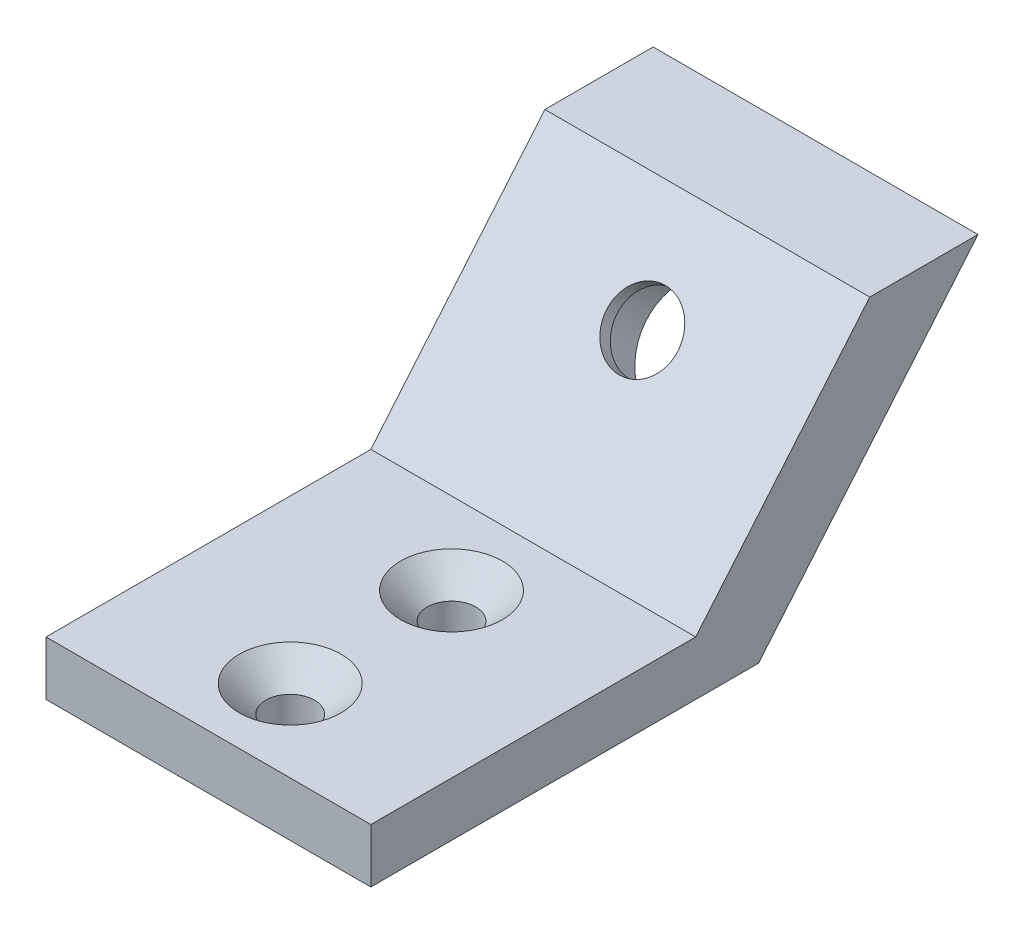
ISO-10303-21;
HEADER;
FILE_DESCRIPTION(('STEP AP214'),'2;1');
FILE_NAME('part.step','',(''),(''),'','','');
FILE_SCHEMA(('AUTOMOTIVE_DESIGN { 1 0 10303 214 1 1 1 1 }'));
ENDSEC;
DATA;
#1=APPLICATION_CONTEXT('core data for automotive mechanical design processes');
#2=APPLICATION_PROTOCOL_DEFINITION('international standard','automotive_design',2000,#1);
#3=PRODUCT_CONTEXT('',#1,'mechanical');
#4=PRODUCT('Part','Part','',(#3));
#5=PRODUCT_RELATED_PRODUCT_CATEGORY('part','',(#4));
#6=PRODUCT_DEFINITION_FORMATION('','',#4);
#7=PRODUCT_DEFINITION_CONTEXT('part definition',#1,'design');
#8=PRODUCT_DEFINITION('design','',#6,#7);
#9=PRODUCT_DEFINITION_SHAPE('','',#8);
#10=(LENGTH_UNIT() NAMED_UNIT(*) SI_UNIT(.MILLI.,.METRE.));
#11=(NAMED_UNIT(*) PLANE_ANGLE_UNIT() SI_UNIT($,.RADIAN.));
#12=(NAMED_UNIT(*) SI_UNIT($,.STERADIAN.) SOLID_ANGLE_UNIT());
#13=UNCERTAINTY_MEASURE_WITH_UNIT(LENGTH_MEASURE(1.E-05),#10,'distance_accuracy_value','');
#14=(GEOMETRIC_REPRESENTATION_CONTEXT(3) GLOBAL_UNCERTAINTY_ASSIGNED_CONTEXT((#13)) GLOBAL_UNIT_ASSIGNED_CONTEXT((#10,
#11,#12)) REPRESENTATION_CONTEXT('',''));
#15=CARTESIAN_POINT('',(0.,0.,0.));
#16=DIRECTION('',(0.,0.,1.));
#17=DIRECTION('',(1.,0.,0.));
#18=AXIS2_PLACEMENT_3D('',#15,#16,#17);
#19=CARTESIAN_POINT('',(-15.,0.,30.));
#20=DIRECTION('',(0.,-1.,0.));
#21=DIRECTION('',(1.,0.,0.));
#22=AXIS2_PLACEMENT_3D('',#19,#20,#21);
#23=PLANE('',#22);
#24=CARTESIAN_POINT('',(0.,0.,7.55));
#25=DIRECTION('',(0.,1.,0.));
#26=DIRECTION('',(0.,0.,1.));
#27=AXIS2_PLACEMENT_3D('',#24,#25,#26);
#28=CIRCLE('',#27,4.7);
#29=CARTESIAN_POINT('',(0.,0.,12.25));
#30=VERTEX_POINT('',#29);
#31=EDGE_CURVE('E166',#30,#30,#28,.T.);
#32=ORIENTED_EDGE('',*,*,#31,.F.);
#33=EDGE_LOOP('',(#32));
#34=FACE_BOUND('',#33,.T.);
#35=CARTESIAN_POINT('',(0.,0.,22.45));
#36=DIRECTION('',(0.,1.,0.));
#37=DIRECTION('',(0.,0.,1.));
#38=AXIS2_PLACEMENT_3D('',#35,#36,#37);
#39=CIRCLE('',#38,4.7);
#40=CARTESIAN_POINT('',(0.,0.,27.15));
#41=VERTEX_POINT('',#40);
#42=EDGE_CURVE('E169',#41,#41,#39,.T.);
#43=ORIENTED_EDGE('',*,*,#42,.F.);
#44=EDGE_LOOP('',(#43));
#45=FACE_BOUND('',#44,.T.);
#46=DIRECTION('',(-1.,0.,0.));
#47=VECTOR('',#46,1.);
#48=CARTESIAN_POINT('',(-15.,0.,0.));
#49=LINE('',#48,#47);
#50=CARTESIAN_POINT('',(15.,0.,0.));
#51=VERTEX_POINT('',#50);
#52=CARTESIAN_POINT('',(-15.,0.,0.));
#53=VERTEX_POINT('',#52);
#54=EDGE_CURVE('E127',#51,#53,#49,.T.);
#55=ORIENTED_EDGE('',*,*,#54,.T.);
#56=DIRECTION('',(0.,0.,-1.));
#57=VECTOR('',#56,1.);
#58=CARTESIAN_POINT('',(-15.,0.,30.));
#59=LINE('',#58,#57);
#60=CARTESIAN_POINT('',(-15.,0.,30.));
#61=VERTEX_POINT('',#60);
#62=EDGE_CURVE('E11',#61,#53,#59,.T.);
#63=ORIENTED_EDGE('',*,*,#62,.F.);
#64=DIRECTION('',(-1.,0.,0.));
#65=VECTOR('',#64,1.);
#66=CARTESIAN_POINT('',(-15.,0.,30.));
#67=LINE('',#66,#65);
#68=CARTESIAN_POINT('',(15.,0.,30.));
#69=VERTEX_POINT('',#68);
#70=EDGE_CURVE('E124',#69,#61,#67,.T.);
#71=ORIENTED_EDGE('',*,*,#70,.F.);
#72=DIRECTION('',(0.,0.,-1.));
#73=VECTOR('',#72,1.);
#74=CARTESIAN_POINT('',(15.,0.,30.));
#75=LINE('',#74,#73);
#76=EDGE_CURVE('E94',#69,#51,#75,.T.);
#77=ORIENTED_EDGE('',*,*,#76,.T.);
#78=EDGE_LOOP('',(#55,#63,#71,#77));
#79=FACE_BOUND('',#78,.T.);
#80=ADVANCED_FACE('F35',(#34,#45,#79),#23,.F.);
#81=CARTESIAN_POINT('',(-15.,-5.,30.));
#82=DIRECTION('',(1.,0.,0.));
#83=DIRECTION('',(0.,0.,-1.));
#84=AXIS2_PLACEMENT_3D('',#81,#82,#83);
#85=PLANE('',#84);
#86=ORIENTED_EDGE('',*,*,#62,.T.);
#87=DIRECTION('',(0.,0.766044443118979,-0.642787609686538));
#88=VECTOR('',#87,1.);
#89=CARTESIAN_POINT('',(-15.,0.,0.));
#90=LINE('',#89,#88);
#91=CARTESIAN_POINT('',(-15.,19.1511110779745,-16.0696902421634));
#92=VERTEX_POINT('',#91);
#93=EDGE_CURVE('E115',#53,#92,#90,.T.);
#94=ORIENTED_EDGE('',*,*,#93,.T.);
#95=DIRECTION('',(0.,0.,-1.));
#96=VECTOR('',#95,1.);
#97=CARTESIAN_POINT('',(-15.,19.1511110779745,-16.0696902421634));
#98=LINE('',#97,#96);
#99=CARTESIAN_POINT('',(-15.,19.1511110779745,-26.0696902421635));
#100=VERTEX_POINT('',#99);
#101=EDGE_CURVE('E144',#92,#100,#98,.T.);
#102=ORIENTED_EDGE('',*,*,#101,.T.);
#103=DIRECTION('',(0.,-0.766044443118979,0.642787609686538));
#104=VECTOR('',#103,1.);
#105=CARTESIAN_POINT('',(-15.,19.1511110779745,-26.0696902421634));
#106=LINE('',#105,#104);
#107=CARTESIAN_POINT('',(-15.,-5.00000000000001,-5.80450184411361));
#108=VERTEX_POINT('',#107);
#109=EDGE_CURVE('E122',#100,#108,#106,.T.);
#110=ORIENTED_EDGE('',*,*,#109,.T.);
#111=DIRECTION('',(0.,0.,-1.));
#112=VECTOR('',#111,1.);
#113=CARTESIAN_POINT('',(-15.,-5.,30.));
#114=LINE('',#113,#112);
#115=CARTESIAN_POINT('',(-15.,-5.,30.));
#116=VERTEX_POINT('',#115);
#117=EDGE_CURVE('E43',#116,#108,#114,.T.);
#118=ORIENTED_EDGE('',*,*,#117,.F.);
#119=DIRECTION('',(0.,-1.,0.));
#120=VECTOR('',#119,1.);
#121=CARTESIAN_POINT('',(-15.,-5.,30.));
#122=LINE('',#121,#120);
#123=EDGE_CURVE('E126',#61,#116,#122,.T.);
#124=ORIENTED_EDGE('',*,*,#123,.F.);
#125=EDGE_LOOP('',(#86,#94,#102,#110,#118,#124));
#126=FACE_BOUND('',#125,.T.);
#127=ADVANCED_FACE('F145',(#126),#85,.F.);
#128=CARTESIAN_POINT('',(-15.,-5.,30.));
#129=DIRECTION('',(0.,1.,0.));
#130=DIRECTION('',(-1.,0.,0.));
#131=AXIS2_PLACEMENT_3D('',#128,#129,#130);
#132=PLANE('',#131);
#133=CARTESIAN_POINT('',(0.,-5.00000000000001,7.55));
#134=DIRECTION('',(0.,1.,0.));
#135=DIRECTION('',(0.,0.,1.));
#136=AXIS2_PLACEMENT_3D('',#133,#134,#135);
#137=CIRCLE('',#136,2.25);
#138=CARTESIAN_POINT('',(0.,-5.00000000000001,9.8));
#139=VERTEX_POINT('',#138);
#140=EDGE_CURVE('E172',#139,#139,#137,.T.);
#141=ORIENTED_EDGE('',*,*,#140,.T.);
#142=EDGE_LOOP('',(#141));
#143=FACE_BOUND('',#142,.T.);
#144=CARTESIAN_POINT('',(0.,-5.00000000000001,22.45));
#145=DIRECTION('',(0.,1.,0.));
#146=DIRECTION('',(0.,0.,1.));
#147=AXIS2_PLACEMENT_3D('',#144,#145,#146);
#148=CIRCLE('',#147,2.25);
#149=CARTESIAN_POINT('',(0.,-5.00000000000001,24.7));
#150=VERTEX_POINT('',#149);
#151=EDGE_CURVE('E175',#150,#150,#148,.T.);
#152=ORIENTED_EDGE('',*,*,#151,.T.);
#153=EDGE_LOOP('',(#152));
#154=FACE_BOUND('',#153,.T.);
#155=ORIENTED_EDGE('',*,*,#117,.T.);
#156=DIRECTION('',(1.,0.,0.));
#157=VECTOR('',#156,1.);
#158=CARTESIAN_POINT('',(-50.5373735048472,-5.00000000000002,-5.80450184411361));
#159=LINE('',#158,#157);
#160=CARTESIAN_POINT('',(15.,-5.,-5.80450184411361));
#161=VERTEX_POINT('',#160);
#162=EDGE_CURVE('E97',#108,#161,#159,.T.);
#163=ORIENTED_EDGE('',*,*,#162,.T.);
#164=DIRECTION('',(0.,0.,-1.));
#165=VECTOR('',#164,1.);
#166=CARTESIAN_POINT('',(15.,-5.,30.));
#167=LINE('',#166,#165);
#168=CARTESIAN_POINT('',(15.,-5.,30.));
#169=VERTEX_POINT('',#168);
#170=EDGE_CURVE('E87',#169,#161,#167,.T.);
#171=ORIENTED_EDGE('',*,*,#170,.F.);
#172=DIRECTION('',(1.,0.,0.));
#173=VECTOR('',#172,1.);
#174=CARTESIAN_POINT('',(-15.,-5.,30.));
#175=LINE('',#174,#173);
#176=EDGE_CURVE('E55',#116,#169,#175,.T.);
#177=ORIENTED_EDGE('',*,*,#176,.F.);
#178=EDGE_LOOP('',(#155,#163,#171,#177));
#179=FACE_BOUND('',#178,.T.);
#180=ADVANCED_FACE('F98',(#143,#154,#179),#132,.F.);
#181=CARTESIAN_POINT('',(15.,-5.,30.));
#182=DIRECTION('',(-1.,0.,0.));
#183=DIRECTION('',(0.,-1.,0.));
#184=AXIS2_PLACEMENT_3D('',#181,#182,#183);
#185=PLANE('',#184);
#186=ORIENTED_EDGE('',*,*,#170,.T.);
#187=DIRECTION('',(0.,0.766044443118979,-0.642787609686538));
#188=VECTOR('',#187,1.);
#189=CARTESIAN_POINT('',(15.,19.1511110779745,-26.0696902421634));
#190=LINE('',#189,#188);
#191=CARTESIAN_POINT('',(15.,19.1511110779745,-26.0696902421634));
#192=VERTEX_POINT('',#191);
#193=EDGE_CURVE('E92',#161,#192,#190,.T.);
#194=ORIENTED_EDGE('',*,*,#193,.T.);
#195=DIRECTION('',(0.,0.,1.));
#196=VECTOR('',#195,1.);
#197=CARTESIAN_POINT('',(15.,19.1511110779745,-16.0696902421634));
#198=LINE('',#197,#196);
#199=CARTESIAN_POINT('',(15.,19.1511110779745,-16.0696902421634));
#200=VERTEX_POINT('',#199);
#201=EDGE_CURVE('E109',#192,#200,#198,.T.);
#202=ORIENTED_EDGE('',*,*,#201,.T.);
#203=DIRECTION('',(0.,-0.766044443118979,0.642787609686538));
#204=VECTOR('',#203,1.);
#205=CARTESIAN_POINT('',(15.,0.,0.));
#206=LINE('',#205,#204);
#207=EDGE_CURVE('E104',#200,#51,#206,.T.);
#208=ORIENTED_EDGE('',*,*,#207,.T.);
#209=ORIENTED_EDGE('',*,*,#76,.F.);
#210=DIRECTION('',(0.,1.,0.));
#211=VECTOR('',#210,1.);
#212=CARTESIAN_POINT('',(15.,-5.,30.));
#213=LINE('',#212,#211);
#214=EDGE_CURVE('E50',#169,#69,#213,.T.);
#215=ORIENTED_EDGE('',*,*,#214,.F.);
#216=EDGE_LOOP('',(#186,#194,#202,#208,#209,#215));
#217=FACE_BOUND('',#216,.T.);
#218=ADVANCED_FACE('F89',(#217),#185,.F.);
#219=CARTESIAN_POINT('',(0.,0.,30.));
#220=DIRECTION('',(0.,0.,1.));
#221=DIRECTION('',(1.,0.,0.));
#222=AXIS2_PLACEMENT_3D('',#219,#220,#221);
#223=PLANE('',#222);
#224=ORIENTED_EDGE('',*,*,#70,.T.);
#225=ORIENTED_EDGE('',*,*,#123,.T.);
#226=ORIENTED_EDGE('',*,*,#176,.T.);
#227=ORIENTED_EDGE('',*,*,#214,.T.);
#228=EDGE_LOOP('',(#224,#225,#226,#227));
#229=FACE_BOUND('',#228,.T.);
#230=ADVANCED_FACE('F146',(#229),#223,.T.);
#231=CARTESIAN_POINT('',(-50.5373735048472,0.,0.));
#232=DIRECTION('',(0.,0.642787609686538,0.766044443118979));
#233=DIRECTION('',(0.,-0.766044443118979,0.642787609686538));
#234=AXIS2_PLACEMENT_3D('',#231,#232,#233);
#235=PLANE('',#234);
#236=CARTESIAN_POINT('',(0.,11.9995943040483,-10.0688551548039));
#237=DIRECTION('',(0.,0.642787609686538,0.766044443118979));
#238=DIRECTION('',(0.,-0.766044443118979,0.642787609686538));
#239=AXIS2_PLACEMENT_3D('',#236,#237,#238);
#240=CIRCLE('',#239,3.3);
#241=CARTESIAN_POINT('',(0.,9.47164764175566,-7.94765604283829));
#242=VERTEX_POINT('',#241);
#243=EDGE_CURVE('E38',#242,#242,#240,.T.);
#244=ORIENTED_EDGE('',*,*,#243,.F.);
#245=EDGE_LOOP('',(#244));
#246=FACE_BOUND('',#245,.T.);
#247=ORIENTED_EDGE('',*,*,#93,.F.);
#248=ORIENTED_EDGE('',*,*,#54,.F.);
#249=ORIENTED_EDGE('',*,*,#207,.F.);
#250=DIRECTION('',(1.,0.,0.));
#251=VECTOR('',#250,1.);
#252=CARTESIAN_POINT('',(-50.5373735048472,19.1511110779745,-16.0696902421634));
#253=LINE('',#252,#251);
#254=EDGE_CURVE('E120',#92,#200,#253,.T.);
#255=ORIENTED_EDGE('',*,*,#254,.F.);
#256=EDGE_LOOP('',(#247,#248,#249,#255));
#257=FACE_BOUND('',#256,.T.);
#258=ADVANCED_FACE('F141',(#246,#257),#235,.T.);
#259=CARTESIAN_POINT('',(-50.5373735048472,19.1511110779745,-16.0696902421634));
#260=DIRECTION('',(0.,1.,0.));
#261=DIRECTION('',(0.,0.,1.));
#262=AXIS2_PLACEMENT_3D('',#259,#260,#261);
#263=PLANE('',#262);
#264=ORIENTED_EDGE('',*,*,#101,.F.);
#265=ORIENTED_EDGE('',*,*,#254,.T.);
#266=ORIENTED_EDGE('',*,*,#201,.F.);
#267=DIRECTION('',(1.,0.,0.));
#268=VECTOR('',#267,1.);
#269=CARTESIAN_POINT('',(-50.5373735048472,19.1511110779745,-26.0696902421634));
#270=LINE('',#269,#268);
#271=EDGE_CURVE('E103',#100,#192,#270,.T.);
#272=ORIENTED_EDGE('',*,*,#271,.F.);
#273=EDGE_LOOP('',(#264,#265,#266,#272));
#274=FACE_BOUND('',#273,.T.);
#275=ADVANCED_FACE('F153',(#274),#263,.T.);
#276=CARTESIAN_POINT('',(-50.5373735048472,19.1511110779745,-26.0696902421634));
#277=DIRECTION('',(0.,-0.642787609686538,-0.766044443118979));
#278=DIRECTION('',(0.,0.766044443118979,-0.642787609686538));
#279=AXIS2_PLACEMENT_3D('',#276,#277,#278);
#280=PLANE('',#279);
#281=CARTESIAN_POINT('',(0.,7.07555553898725,-15.9370960431385));
#282=DIRECTION('',(0.,-0.642787609686538,-0.766044443118979));
#283=DIRECTION('',(0.,0.766044443118979,-0.642787609686538));
#284=AXIS2_PLACEMENT_3D('',#281,#282,#283);
#285=CIRCLE('',#284,5.525);
#286=CARTESIAN_POINT('',(0.,11.3079510872196,-19.4884975866567));
#287=VERTEX_POINT('',#286);
#288=EDGE_CURVE('E184',#287,#287,#285,.T.);
#289=ORIENTED_EDGE('',*,*,#288,.F.);
#290=EDGE_LOOP('',(#289));
#291=FACE_BOUND('',#290,.T.);
#292=ORIENTED_EDGE('',*,*,#109,.F.);
#293=ORIENTED_EDGE('',*,*,#271,.T.);
#294=ORIENTED_EDGE('',*,*,#193,.F.);
#295=ORIENTED_EDGE('',*,*,#162,.F.);
#296=EDGE_LOOP('',(#292,#293,#294,#295));
#297=FACE_BOUND('',#296,.T.);
#298=ADVANCED_FACE('F106',(#291,#297),#280,.T.);
#299=CARTESIAN_POINT('',(0.,7.07555553898725,-15.9370960431385));
#300=DIRECTION('',(0.,-0.642787609686538,-0.766044443118979));
#301=DIRECTION('',(0.,0.766044443118979,-0.642787609686538));
#302=AXIS2_PLACEMENT_3D('',#299,#300,#301);
#303=CYLINDRICAL_SURFACE('',#302,3.3);
#304=ORIENTED_EDGE('',*,*,#243,.T.);
#305=EDGE_LOOP('',(#304));
#306=FACE_BOUND('',#305,.T.);
#307=CARTESIAN_POINT('',(0.,11.1893962409811,-11.0344116071771));
#308=DIRECTION('',(0.,-0.642787609686538,-0.766044443118979));
#309=DIRECTION('',(0.,0.766044443118979,-0.642787609686538));
#310=AXIS2_PLACEMENT_3D('',#307,#308,#309);
#311=CIRCLE('',#310,3.3);
#312=CARTESIAN_POINT('',(0.,13.7173429032737,-13.1556107191426));
#313=VERTEX_POINT('',#312);
#314=EDGE_CURVE('E113',#313,#313,#311,.T.);
#315=ORIENTED_EDGE('',*,*,#314,.T.);
#316=EDGE_LOOP('',(#315));
#317=FACE_BOUND('',#316,.T.);
#318=ADVANCED_FACE('F201',(#306,#317),#303,.F.);
#319=CARTESIAN_POINT('',(5.5,11.1893962409811,-11.0344116071771));
#320=DIRECTION('',(0.,0.642787609686538,0.766044443118979));
#321=DIRECTION('',(0.,-0.766044443118979,0.642787609686538));
#322=AXIS2_PLACEMENT_3D('',#319,#320,#321);
#323=PLANE('',#322);
#324=ORIENTED_EDGE('',*,*,#314,.F.);
#325=EDGE_LOOP('',(#324));
#326=FACE_BOUND('',#325,.T.);
#327=CARTESIAN_POINT('',(0.,11.1893962409811,-11.0344116071771));
#328=DIRECTION('',(0.,-0.642787609686538,-0.766044443118979));
#329=DIRECTION('',(0.,0.766044443118979,-0.642787609686538));
#330=AXIS2_PLACEMENT_3D('',#327,#328,#329);
#331=CIRCLE('',#330,5.5);
#332=CARTESIAN_POINT('',(0.,15.4026406781355,-14.569743460453));
#333=VERTEX_POINT('',#332);
#334=EDGE_CURVE('E190',#333,#333,#331,.T.);
#335=ORIENTED_EDGE('',*,*,#334,.T.);
#336=EDGE_LOOP('',(#335));
#337=FACE_BOUND('',#336,.T.);
#338=ADVANCED_FACE('F206',(#326,#337),#323,.F.);
#339=CARTESIAN_POINT('',(0.,7.07555553898725,-15.9370960431385));
#340=DIRECTION('',(0.,-0.642787609686538,-0.766044443118979));
#341=DIRECTION('',(0.,0.766044443118979,-0.642787609686538));
#342=AXIS2_PLACEMENT_3D('',#339,#340,#341);
#343=CYLINDRICAL_SURFACE('',#342,5.5);
#344=ORIENTED_EDGE('',*,*,#334,.F.);
#345=EDGE_LOOP('',(#344));
#346=FACE_BOUND('',#345,.T.);
#347=CARTESIAN_POINT('',(0.,7.09162522922941,-15.9179449320606));
#348=DIRECTION('',(0.,-0.642787609686538,-0.766044443118979));
#349=DIRECTION('',(0.,0.766044443118979,-0.642787609686538));
#350=AXIS2_PLACEMENT_3D('',#347,#348,#349);
#351=CIRCLE('',#350,5.5);
#352=CARTESIAN_POINT('',(0.,11.3048696663838,-19.4532767853365));
#353=VERTEX_POINT('',#352);
#354=EDGE_CURVE('E187',#353,#353,#351,.T.);
#355=ORIENTED_EDGE('',*,*,#354,.T.);
#356=EDGE_LOOP('',(#355));
#357=FACE_BOUND('',#356,.T.);
#358=ADVANCED_FACE('F210',(#346,#357),#343,.F.);
#359=CARTESIAN_POINT('',(0.,7.07555553898725,-15.9370960431385));
#360=DIRECTION('',(0.,-0.642787609686538,-0.766044443118979));
#361=DIRECTION('',(0.,0.766044443118979,-0.642787609686538));
#362=AXIS2_PLACEMENT_3D('',#359,#360,#361);
#363=CONICAL_SURFACE('',#362,5.525,0.785398163397435);
#364=ORIENTED_EDGE('',*,*,#354,.F.);
#365=EDGE_LOOP('',(#364));
#366=FACE_BOUND('',#365,.T.);
#367=ORIENTED_EDGE('',*,*,#288,.T.);
#368=EDGE_LOOP('',(#367));
#369=FACE_BOUND('',#368,.T.);
#370=ADVANCED_FACE('F214',(#366,#369),#363,.F.);
#371=CARTESIAN_POINT('',(0.,0.,22.45));
#372=DIRECTION('',(0.,1.,0.));
#373=DIRECTION('',(0.,0.,1.));
#374=AXIS2_PLACEMENT_3D('',#371,#372,#373);
#375=CYLINDRICAL_SURFACE('',#374,2.25);
#376=ORIENTED_EDGE('',*,*,#151,.F.);
#377=EDGE_LOOP('',(#376));
#378=FACE_BOUND('',#377,.T.);
#379=CARTESIAN_POINT('',(0.,-2.45,22.45));
#380=DIRECTION('',(0.,1.,0.));
#381=DIRECTION('',(0.,0.,1.));
#382=AXIS2_PLACEMENT_3D('',#379,#380,#381);
#383=CIRCLE('',#382,2.25);
#384=CARTESIAN_POINT('',(0.,-2.45,24.7));
#385=VERTEX_POINT('',#384);
#386=EDGE_CURVE('E171',#385,#385,#383,.T.);
#387=ORIENTED_EDGE('',*,*,#386,.T.);
#388=EDGE_LOOP('',(#387));
#389=FACE_BOUND('',#388,.T.);
#390=ADVANCED_FACE('F218',(#378,#389),#375,.F.);
#391=CARTESIAN_POINT('',(0.,0.,22.45));
#392=DIRECTION('',(0.,1.,0.));
#393=DIRECTION('',(0.,0.,1.));
#394=AXIS2_PLACEMENT_3D('',#391,#392,#393);
#395=CONICAL_SURFACE('',#394,4.7,0.785398163397448);
#396=ORIENTED_EDGE('',*,*,#386,.F.);
#397=EDGE_LOOP('',(#396));
#398=FACE_BOUND('',#397,.T.);
#399=ORIENTED_EDGE('',*,*,#42,.T.);
#400=EDGE_LOOP('',(#399));
#401=FACE_BOUND('',#400,.T.);
#402=ADVANCED_FACE('F222',(#398,#401),#395,.F.);
#403=CARTESIAN_POINT('',(0.,0.,7.55));
#404=DIRECTION('',(0.,1.,0.));
#405=DIRECTION('',(0.,0.,1.));
#406=AXIS2_PLACEMENT_3D('',#403,#404,#405);
#407=CYLINDRICAL_SURFACE('',#406,2.25);
#408=ORIENTED_EDGE('',*,*,#140,.F.);
#409=EDGE_LOOP('',(#408));
#410=FACE_BOUND('',#409,.T.);
#411=CARTESIAN_POINT('',(0.,-2.45,7.55));
#412=DIRECTION('',(0.,1.,0.));
#413=DIRECTION('',(0.,0.,1.));
#414=AXIS2_PLACEMENT_3D('',#411,#412,#413);
#415=CIRCLE('',#414,2.25);
#416=CARTESIAN_POINT('',(0.,-2.45,9.8));
#417=VERTEX_POINT('',#416);
#418=EDGE_CURVE('E178',#417,#417,#415,.T.);
#419=ORIENTED_EDGE('',*,*,#418,.T.);
#420=EDGE_LOOP('',(#419));
#421=FACE_BOUND('',#420,.T.);
#422=ADVANCED_FACE('F226',(#410,#421),#407,.F.);
#423=CARTESIAN_POINT('',(0.,0.,7.55));
#424=DIRECTION('',(0.,1.,0.));
#425=DIRECTION('',(0.,0.,1.));
#426=AXIS2_PLACEMENT_3D('',#423,#424,#425);
#427=CONICAL_SURFACE('',#426,4.7,0.785398163397448);
#428=ORIENTED_EDGE('',*,*,#418,.F.);
#429=EDGE_LOOP('',(#428));
#430=FACE_BOUND('',#429,.T.);
#431=ORIENTED_EDGE('',*,*,#31,.T.);
#432=EDGE_LOOP('',(#431));
#433=FACE_BOUND('',#432,.T.);
#434=ADVANCED_FACE('F230',(#430,#433),#427,.F.);
#435=CLOSED_SHELL('',(#80,#127,#180,#218,#230,#258,#275,#298,#318,#338,#358,#370,#390,#402,#422,#434));
#436=MANIFOLD_SOLID_BREP('B2',#435);
#437=ADVANCED_BREP_SHAPE_REPRESENTATION('',(#18,#436),#14);
#438=SHAPE_DEFINITION_REPRESENTATION(#9,#437);
ENDSEC;
END-ISO-10303-21;
